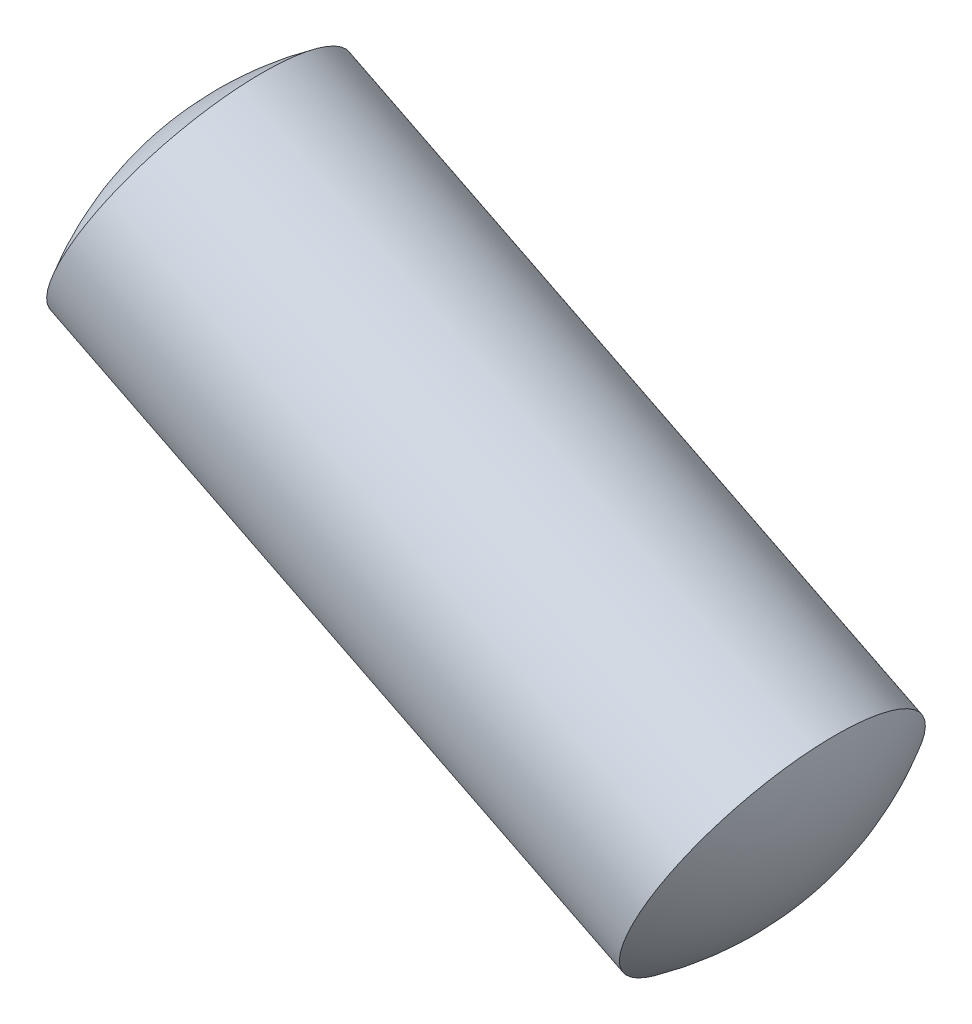
ISO-10303-21;
HEADER;
FILE_DESCRIPTION(('STEP AP214'),'2;1');
FILE_NAME('part.step','',(''),(''),'','','');
FILE_SCHEMA(('AUTOMOTIVE_DESIGN { 1 0 10303 214 1 1 1 1 }'));
ENDSEC;
DATA;
#1=APPLICATION_CONTEXT('core data for automotive mechanical design processes');
#2=APPLICATION_PROTOCOL_DEFINITION('international standard','automotive_design',2000,#1);
#3=PRODUCT_CONTEXT('',#1,'mechanical');
#4=PRODUCT('Part','Part','',(#3));
#5=PRODUCT_RELATED_PRODUCT_CATEGORY('part','',(#4));
#6=PRODUCT_DEFINITION_FORMATION('','',#4);
#7=PRODUCT_DEFINITION_CONTEXT('part definition',#1,'design');
#8=PRODUCT_DEFINITION('design','',#6,#7);
#9=PRODUCT_DEFINITION_SHAPE('','',#8);
#10=(LENGTH_UNIT() NAMED_UNIT(*) SI_UNIT(.MILLI.,.METRE.));
#11=(NAMED_UNIT(*) PLANE_ANGLE_UNIT() SI_UNIT($,.RADIAN.));
#12=(NAMED_UNIT(*) SI_UNIT($,.STERADIAN.) SOLID_ANGLE_UNIT());
#13=UNCERTAINTY_MEASURE_WITH_UNIT(LENGTH_MEASURE(1.E-05),#10,'distance_accuracy_value','');
#14=(GEOMETRIC_REPRESENTATION_CONTEXT(3) GLOBAL_UNCERTAINTY_ASSIGNED_CONTEXT((#13)) GLOBAL_UNIT_ASSIGNED_CONTEXT((#10,
#11,#12)) REPRESENTATION_CONTEXT('',''));
#15=CARTESIAN_POINT('',(0.,0.,0.));
#16=DIRECTION('',(0.,0.,1.));
#17=DIRECTION('',(1.,0.,0.));
#18=AXIS2_PLACEMENT_3D('',#15,#16,#17);
#19=CARTESIAN_POINT('',(19.940910149298,-10.0113837246224,0.599999999999989));
#20=DIRECTION('',(-0.448680433871934,-0.893692267092254,0.));
#21=DIRECTION('',(0.893692267092254,-0.448680433871934,0.));
#22=AXIS2_PLACEMENT_3D('',#19,#20,#21);
#23=SPHERICAL_SURFACE('',#22,2.);
#24=CARTESIAN_POINT('',(19.940910149298,-10.0113837246224,0.599999999999989));
#25=DIRECTION('',(-0.893692267092254,0.448680433871934,0.));
#26=DIRECTION('',(0.,0.,-1.));
#27=AXIS2_PLACEMENT_3D('',#24,#25,#26);
#28=SPHERICAL_SURFACE('',#27,2.);
#29=CARTESIAN_POINT('',(21.4888305622333,-10.7885210324506,0.599999999999989));
#30=DIRECTION('',(-0.893692267092254,0.448680433871934,0.));
#31=DIRECTION('',(0.,0.,-1.));
#32=AXIS2_PLACEMENT_3D('',#29,#30,#31);
#33=CIRCLE('',#32,1.);
#34=CARTESIAN_POINT('',(21.4888305622333,-10.7885210324506,-0.400000000000011));
#35=VERTEX_POINT('',#34);
#36=EDGE_CURVE('E11',#35,#35,#33,.T.);
#37=ORIENTED_EDGE('',*,*,#36,.F.);
#38=EDGE_LOOP('',(#37));
#39=FACE_BOUND('',#38,.T.);
#40=ADVANCED_FACE('F17',(#39),#28,.T.);
#41=CARTESIAN_POINT('',(18.934703469215,-9.50621514880667,0.6));
#42=DIRECTION('',(-0.448680433871934,-0.893692267092254,0.));
#43=DIRECTION('',(-0.893692267092254,0.448680433871934,0.));
#44=AXIS2_PLACEMENT_3D('',#41,#42,#43);
#45=SPHERICAL_SURFACE('',#44,2.);
#46=CARTESIAN_POINT('',(18.934703469215,-9.50621514880667,0.6));
#47=DIRECTION('',(-0.893692267092254,0.448680433871934,0.));
#48=DIRECTION('',(0.,0.,-1.));
#49=AXIS2_PLACEMENT_3D('',#46,#47,#48);
#50=SPHERICAL_SURFACE('',#49,2.);
#51=CARTESIAN_POINT('',(17.3867830562798,-8.72907784097843,0.599999999999989));
#52=DIRECTION('',(-0.893692267092254,0.448680433871934,0.));
#53=DIRECTION('',(0.,0.,-1.));
#54=AXIS2_PLACEMENT_3D('',#51,#52,#53);
#55=CIRCLE('',#54,1.);
#56=CARTESIAN_POINT('',(17.3867830562798,-8.72907784097843,-0.400000000000011));
#57=VERTEX_POINT('',#56);
#58=EDGE_CURVE('E21',#57,#57,#55,.T.);
#59=ORIENTED_EDGE('',*,*,#58,.T.);
#60=EDGE_LOOP('',(#59));
#61=FACE_BOUND('',#60,.T.);
#62=ADVANCED_FACE('F40',(#61),#50,.T.);
#63=CARTESIAN_POINT('',(18.4122949327682,-9.24393863884654,0.599999999999989));
#64=DIRECTION('',(-0.893692267092254,0.448680433871934,0.));
#65=DIRECTION('',(0.,0.,-1.));
#66=AXIS2_PLACEMENT_3D('',#63,#64,#65);
#67=CYLINDRICAL_SURFACE('',#66,1.);
#68=ORIENTED_EDGE('',*,*,#36,.T.);
#69=EDGE_LOOP('',(#68));
#70=FACE_BOUND('',#69,.T.);
#71=ORIENTED_EDGE('',*,*,#58,.F.);
#72=EDGE_LOOP('',(#71));
#73=FACE_BOUND('',#72,.T.);
#74=ADVANCED_FACE('F19',(#70,#73),#67,.T.);
#75=CLOSED_SHELL('',(#40,#62,#74));
#76=MANIFOLD_SOLID_BREP('B1',#75);
#77=ADVANCED_BREP_SHAPE_REPRESENTATION('',(#18,#76),#14);
#78=SHAPE_DEFINITION_REPRESENTATION(#9,#77);
ENDSEC;
END-ISO-10303-21;
